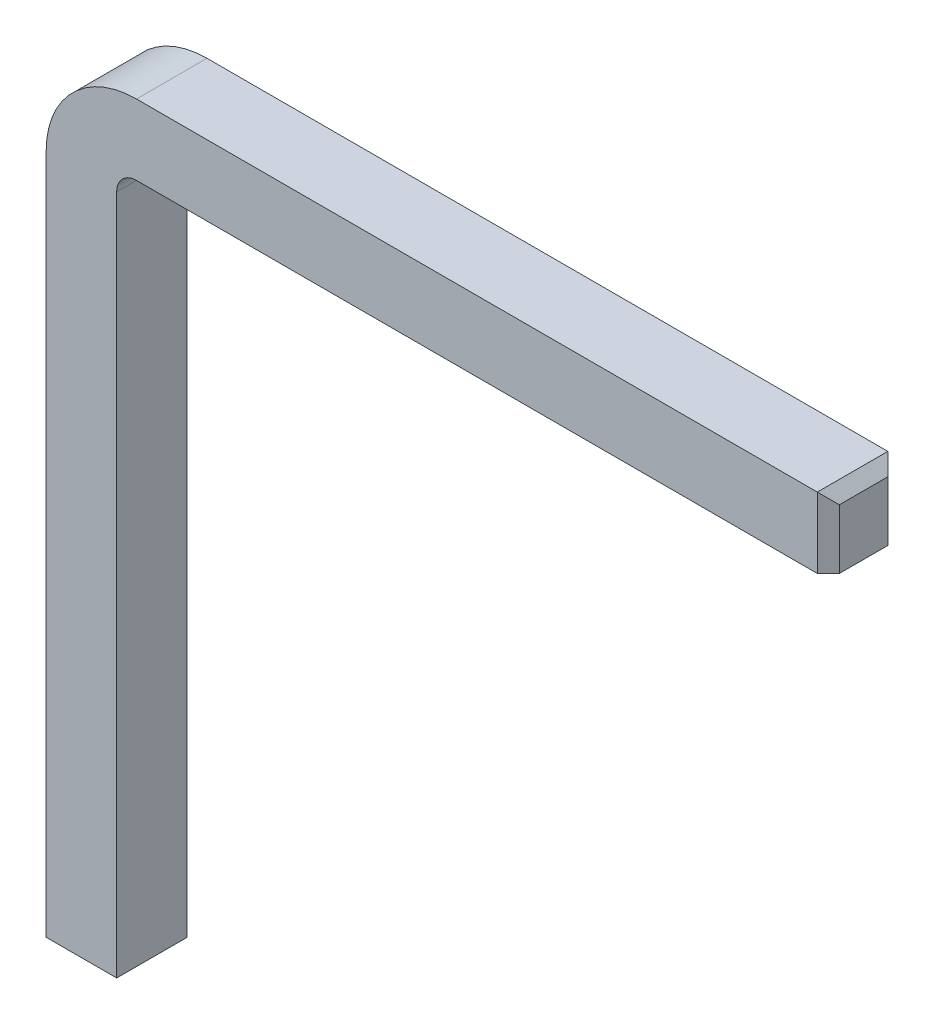
ISO-10303-21;
HEADER;
FILE_DESCRIPTION(('STEP AP214'),'2;1');
FILE_NAME('part.step','',(''),(''),'','','');
FILE_SCHEMA(('AUTOMOTIVE_DESIGN { 1 0 10303 214 1 1 1 1 }'));
ENDSEC;
DATA;
#1=APPLICATION_CONTEXT('core data for automotive mechanical design processes');
#2=APPLICATION_PROTOCOL_DEFINITION('international standard','automotive_design',2000,#1);
#3=PRODUCT_CONTEXT('',#1,'mechanical');
#4=PRODUCT('Part','Part','',(#3));
#5=PRODUCT_RELATED_PRODUCT_CATEGORY('part','',(#4));
#6=PRODUCT_DEFINITION_FORMATION('','',#4);
#7=PRODUCT_DEFINITION_CONTEXT('part definition',#1,'design');
#8=PRODUCT_DEFINITION('design','',#6,#7);
#9=PRODUCT_DEFINITION_SHAPE('','',#8);
#10=(LENGTH_UNIT() NAMED_UNIT(*) SI_UNIT(.MILLI.,.METRE.));
#11=(NAMED_UNIT(*) PLANE_ANGLE_UNIT() SI_UNIT($,.RADIAN.));
#12=(NAMED_UNIT(*) SI_UNIT($,.STERADIAN.) SOLID_ANGLE_UNIT());
#13=UNCERTAINTY_MEASURE_WITH_UNIT(LENGTH_MEASURE(1.E-05),#10,'distance_accuracy_value','');
#14=(GEOMETRIC_REPRESENTATION_CONTEXT(3) GLOBAL_UNCERTAINTY_ASSIGNED_CONTEXT((#13)) GLOBAL_UNIT_ASSIGNED_CONTEXT((#10,
#11,#12)) REPRESENTATION_CONTEXT('',''));
#15=CARTESIAN_POINT('',(0.,0.,0.));
#16=DIRECTION('',(0.,0.,1.));
#17=DIRECTION('',(1.,0.,0.));
#18=AXIS2_PLACEMENT_3D('',#15,#16,#17);
#19=CARTESIAN_POINT('',(0.5,7.1,-0.32));
#20=DIRECTION('',(0.,1.,0.));
#21=DIRECTION('',(-1.,0.,0.));
#22=AXIS2_PLACEMENT_3D('',#19,#20,#21);
#23=PLANE('',#22);
#24=DIRECTION('',(1.,0.,0.));
#25=VECTOR('',#24,1.);
#26=CARTESIAN_POINT('',(0.5,7.1,0.32));
#27=LINE('',#26,#25);
#28=CARTESIAN_POINT('',(0.5,7.1,0.32));
#29=VERTEX_POINT('',#28);
#30=CARTESIAN_POINT('',(6.68,7.1,0.32));
#31=VERTEX_POINT('',#30);
#32=EDGE_CURVE('E177',#29,#31,#27,.T.);
#33=ORIENTED_EDGE('',*,*,#32,.T.);
#34=DIRECTION('',(0.,0.,-1.));
#35=VECTOR('',#34,1.);
#36=CARTESIAN_POINT('',(6.68,7.1,-0.32));
#37=LINE('',#36,#35);
#38=CARTESIAN_POINT('',(6.68,7.1,-0.32));
#39=VERTEX_POINT('',#38);
#40=EDGE_CURVE('E11',#31,#39,#37,.T.);
#41=ORIENTED_EDGE('',*,*,#40,.T.);
#42=DIRECTION('',(1.,0.,0.));
#43=VECTOR('',#42,1.);
#44=CARTESIAN_POINT('',(0.5,7.1,-0.32));
#45=LINE('',#44,#43);
#46=CARTESIAN_POINT('',(0.5,7.1,-0.32));
#47=VERTEX_POINT('',#46);
#48=EDGE_CURVE('E180',#47,#39,#45,.T.);
#49=ORIENTED_EDGE('',*,*,#48,.F.);
#50=DIRECTION('',(0.,0.,1.));
#51=VECTOR('',#50,1.);
#52=CARTESIAN_POINT('',(0.5,7.1,-0.32));
#53=LINE('',#52,#51);
#54=EDGE_CURVE('E157',#47,#29,#53,.T.);
#55=ORIENTED_EDGE('',*,*,#54,.T.);
#56=EDGE_LOOP('',(#33,#41,#49,#55));
#57=FACE_BOUND('',#56,.T.);
#58=ADVANCED_FACE('F33',(#57),#23,.T.);
#59=CARTESIAN_POINT('',(0.5,6.46,-0.32));
#60=DIRECTION('',(0.,-1.,0.));
#61=DIRECTION('',(1.,0.,0.));
#62=AXIS2_PLACEMENT_3D('',#59,#60,#61);
#63=PLANE('',#62);
#64=DIRECTION('',(1.,0.,0.));
#65=VECTOR('',#64,1.);
#66=CARTESIAN_POINT('',(0.5,6.46,-0.32));
#67=LINE('',#66,#65);
#68=CARTESIAN_POINT('',(0.5,6.46,-0.32));
#69=VERTEX_POINT('',#68);
#70=CARTESIAN_POINT('',(6.68,6.46,-0.32));
#71=VERTEX_POINT('',#70);
#72=EDGE_CURVE('E133',#69,#71,#67,.T.);
#73=ORIENTED_EDGE('',*,*,#72,.T.);
#74=DIRECTION('',(0.707106781186548,0.,0.707106781186547));
#75=VECTOR('',#74,1.);
#76=CARTESIAN_POINT('',(3.59,6.46,-3.41));
#77=LINE('',#76,#75);
#78=CARTESIAN_POINT('',(6.78,6.46,-0.219999999999999));
#79=VERTEX_POINT('',#78);
#80=EDGE_CURVE('E42',#71,#79,#77,.T.);
#81=ORIENTED_EDGE('',*,*,#80,.T.);
#82=DIRECTION('',(0.,0.,-1.));
#83=VECTOR('',#82,1.);
#84=CARTESIAN_POINT('',(6.78,6.46,-0.32));
#85=LINE('',#84,#83);
#86=CARTESIAN_POINT('',(6.78,6.46,0.219999999999999));
#87=VERTEX_POINT('',#86);
#88=EDGE_CURVE('E137',#87,#79,#85,.T.);
#89=ORIENTED_EDGE('',*,*,#88,.F.);
#90=DIRECTION('',(-0.707106781186548,0.,0.707106781186547));
#91=VECTOR('',#90,1.);
#92=CARTESIAN_POINT('',(3.91,6.46,3.09));
#93=LINE('',#92,#91);
#94=CARTESIAN_POINT('',(6.68,6.46,0.32));
#95=VERTEX_POINT('',#94);
#96=EDGE_CURVE('E209',#87,#95,#93,.T.);
#97=ORIENTED_EDGE('',*,*,#96,.T.);
#98=DIRECTION('',(1.,0.,0.));
#99=VECTOR('',#98,1.);
#100=CARTESIAN_POINT('',(0.5,6.46,0.32));
#101=LINE('',#100,#99);
#102=CARTESIAN_POINT('',(0.5,6.46,0.32));
#103=VERTEX_POINT('',#102);
#104=EDGE_CURVE('E174',#103,#95,#101,.T.);
#105=ORIENTED_EDGE('',*,*,#104,.F.);
#106=DIRECTION('',(0.,0.,-1.));
#107=VECTOR('',#106,1.);
#108=CARTESIAN_POINT('',(0.5,6.46,-0.32));
#109=LINE('',#108,#107);
#110=EDGE_CURVE('E154',#103,#69,#109,.T.);
#111=ORIENTED_EDGE('',*,*,#110,.T.);
#112=EDGE_LOOP('',(#73,#81,#89,#97,#105,#111));
#113=FACE_BOUND('',#112,.T.);
#114=ADVANCED_FACE('F231',(#113),#63,.T.);
#115=CARTESIAN_POINT('',(0.5,6.28,0.));
#116=DIRECTION('',(0.,0.,-1.));
#117=DIRECTION('',(-1.,0.,0.));
#118=AXIS2_PLACEMENT_3D('',#115,#116,#117);
#119=CYLINDRICAL_SURFACE('',#118,0.819999999999999);
#120=DIRECTION('',(0.,0.,1.));
#121=VECTOR('',#120,1.);
#122=CARTESIAN_POINT('',(-0.319999999999999,6.28,-0.32));
#123=LINE('',#122,#121);
#124=CARTESIAN_POINT('',(-0.319999999999999,6.28,-0.32));
#125=VERTEX_POINT('',#124);
#126=CARTESIAN_POINT('',(-0.319999999999999,6.28,0.32));
#127=VERTEX_POINT('',#126);
#128=EDGE_CURVE('E148',#125,#127,#123,.T.);
#129=ORIENTED_EDGE('',*,*,#128,.T.);
#130=CARTESIAN_POINT('',(0.5,6.28,0.32));
#131=DIRECTION('',(0.,0.,-1.));
#132=DIRECTION('',(-1.,0.,0.));
#133=AXIS2_PLACEMENT_3D('',#130,#131,#132);
#134=CIRCLE('',#133,0.819999999999999);
#135=EDGE_CURVE('E167',#127,#29,#134,.T.);
#136=ORIENTED_EDGE('',*,*,#135,.T.);
#137=ORIENTED_EDGE('',*,*,#54,.F.);
#138=CARTESIAN_POINT('',(0.5,6.28,-0.32));
#139=DIRECTION('',(0.,0.,-1.));
#140=DIRECTION('',(-1.,0.,0.));
#141=AXIS2_PLACEMENT_3D('',#138,#139,#140);
#142=CIRCLE('',#141,0.819999999999999);
#143=EDGE_CURVE('E138',#125,#47,#142,.T.);
#144=ORIENTED_EDGE('',*,*,#143,.F.);
#145=EDGE_LOOP('',(#129,#136,#137,#144));
#146=FACE_BOUND('',#145,.T.);
#147=ADVANCED_FACE('F239',(#146),#119,.T.);
#148=CARTESIAN_POINT('',(0.5,6.28,0.));
#149=DIRECTION('',(0.,0.,-1.));
#150=DIRECTION('',(-1.,0.,0.));
#151=AXIS2_PLACEMENT_3D('',#148,#149,#150);
#152=CYLINDRICAL_SURFACE('',#151,0.179999999999999);
#153=DIRECTION('',(0.,0.,-1.));
#154=VECTOR('',#153,1.);
#155=CARTESIAN_POINT('',(0.320000000000001,6.28,-0.32));
#156=LINE('',#155,#154);
#157=CARTESIAN_POINT('',(0.320000000000001,6.28,0.32));
#158=VERTEX_POINT('',#157);
#159=CARTESIAN_POINT('',(0.320000000000001,6.28,-0.32));
#160=VERTEX_POINT('',#159);
#161=EDGE_CURVE('E141',#158,#160,#156,.T.);
#162=ORIENTED_EDGE('',*,*,#161,.T.);
#163=CARTESIAN_POINT('',(0.5,6.28,-0.32));
#164=DIRECTION('',(0.,0.,-1.));
#165=DIRECTION('',(-1.,0.,0.));
#166=AXIS2_PLACEMENT_3D('',#163,#164,#165);
#167=CIRCLE('',#166,0.179999999999999);
#168=EDGE_CURVE('E125',#160,#69,#167,.T.);
#169=ORIENTED_EDGE('',*,*,#168,.T.);
#170=ORIENTED_EDGE('',*,*,#110,.F.);
#171=CARTESIAN_POINT('',(0.5,6.28,0.32));
#172=DIRECTION('',(0.,0.,-1.));
#173=DIRECTION('',(-1.,0.,0.));
#174=AXIS2_PLACEMENT_3D('',#171,#172,#173);
#175=CIRCLE('',#174,0.179999999999999);
#176=EDGE_CURVE('E144',#158,#103,#175,.T.);
#177=ORIENTED_EDGE('',*,*,#176,.F.);
#178=EDGE_LOOP('',(#162,#169,#170,#177));
#179=FACE_BOUND('',#178,.T.);
#180=ADVANCED_FACE('F142',(#179),#152,.F.);
#181=CARTESIAN_POINT('',(0.320000000000001,6.28,-0.32));
#182=DIRECTION('',(-1.,0.,0.));
#183=DIRECTION('',(0.,0.,1.));
#184=AXIS2_PLACEMENT_3D('',#181,#182,#183);
#185=PLANE('',#184);
#186=DIRECTION('',(0.,-1.,0.));
#187=VECTOR('',#186,1.);
#188=CARTESIAN_POINT('',(0.320000000000001,6.28,0.32));
#189=LINE('',#188,#187);
#190=CARTESIAN_POINT('',(0.320000000000001,0.1,0.32));
#191=VERTEX_POINT('',#190);
#192=EDGE_CURVE('E246',#158,#191,#189,.T.);
#193=ORIENTED_EDGE('',*,*,#192,.T.);
#194=DIRECTION('',(0.,0.,-1.));
#195=VECTOR('',#194,1.);
#196=CARTESIAN_POINT('',(0.320000000000001,0.1,-0.32));
#197=LINE('',#196,#195);
#198=CARTESIAN_POINT('',(0.320000000000001,0.1,-0.32));
#199=VERTEX_POINT('',#198);
#200=EDGE_CURVE('E153',#191,#199,#197,.T.);
#201=ORIENTED_EDGE('',*,*,#200,.T.);
#202=DIRECTION('',(0.,-1.,0.));
#203=VECTOR('',#202,1.);
#204=CARTESIAN_POINT('',(0.320000000000001,6.28,-0.32));
#205=LINE('',#204,#203);
#206=EDGE_CURVE('E130',#160,#199,#205,.T.);
#207=ORIENTED_EDGE('',*,*,#206,.F.);
#208=ORIENTED_EDGE('',*,*,#161,.F.);
#209=EDGE_LOOP('',(#193,#201,#207,#208));
#210=FACE_BOUND('',#209,.T.);
#211=ADVANCED_FACE('F151',(#210),#185,.F.);
#212=CARTESIAN_POINT('',(-0.319999999999999,6.28,-0.32));
#213=DIRECTION('',(0.,0.,1.));
#214=DIRECTION('',(1.,0.,0.));
#215=AXIS2_PLACEMENT_3D('',#212,#213,#214);
#216=PLANE('',#215);
#217=ORIENTED_EDGE('',*,*,#206,.T.);
#218=DIRECTION('',(-1.,0.,0.));
#219=VECTOR('',#218,1.);
#220=CARTESIAN_POINT('',(-0.319999999999999,0.1,-0.32));
#221=LINE('',#220,#219);
#222=CARTESIAN_POINT('',(-0.319999999999999,0.1,-0.32));
#223=VERTEX_POINT('',#222);
#224=EDGE_CURVE('E186',#199,#223,#221,.T.);
#225=ORIENTED_EDGE('',*,*,#224,.T.);
#226=DIRECTION('',(0.,-1.,0.));
#227=VECTOR('',#226,1.);
#228=CARTESIAN_POINT('',(-0.319999999999999,6.28,-0.32));
#229=LINE('',#228,#227);
#230=EDGE_CURVE('E155',#125,#223,#229,.T.);
#231=ORIENTED_EDGE('',*,*,#230,.F.);
#232=ORIENTED_EDGE('',*,*,#143,.T.);
#233=ORIENTED_EDGE('',*,*,#48,.T.);
#234=DIRECTION('',(0.,-1.,0.));
#235=VECTOR('',#234,1.);
#236=CARTESIAN_POINT('',(6.68,6.46,-0.32));
#237=LINE('',#236,#235);
#238=EDGE_CURVE('E184',#39,#71,#237,.T.);
#239=ORIENTED_EDGE('',*,*,#238,.T.);
#240=ORIENTED_EDGE('',*,*,#72,.F.);
#241=ORIENTED_EDGE('',*,*,#168,.F.);
#242=EDGE_LOOP('',(#217,#225,#231,#232,#233,#239,#240,#241));
#243=FACE_BOUND('',#242,.T.);
#244=ADVANCED_FACE('F127',(#243),#216,.F.);
#245=CARTESIAN_POINT('',(-0.319999999999999,6.28,-0.32));
#246=DIRECTION('',(1.,0.,0.));
#247=DIRECTION('',(0.,0.,-1.));
#248=AXIS2_PLACEMENT_3D('',#245,#246,#247);
#249=PLANE('',#248);
#250=ORIENTED_EDGE('',*,*,#230,.T.);
#251=DIRECTION('',(0.,0.,1.));
#252=VECTOR('',#251,1.);
#253=CARTESIAN_POINT('',(-0.319999999999999,0.1,-0.32));
#254=LINE('',#253,#252);
#255=CARTESIAN_POINT('',(-0.319999999999999,0.1,0.32));
#256=VERTEX_POINT('',#255);
#257=EDGE_CURVE('E197',#223,#256,#254,.T.);
#258=ORIENTED_EDGE('',*,*,#257,.T.);
#259=DIRECTION('',(0.,-1.,0.));
#260=VECTOR('',#259,1.);
#261=CARTESIAN_POINT('',(-0.319999999999999,6.28,0.32));
#262=LINE('',#261,#260);
#263=EDGE_CURVE('E160',#127,#256,#262,.T.);
#264=ORIENTED_EDGE('',*,*,#263,.F.);
#265=ORIENTED_EDGE('',*,*,#128,.F.);
#266=EDGE_LOOP('',(#250,#258,#264,#265));
#267=FACE_BOUND('',#266,.T.);
#268=ADVANCED_FACE('F264',(#267),#249,.F.);
#269=CARTESIAN_POINT('',(-0.319999999999999,6.28,0.32));
#270=DIRECTION('',(0.,0.,-1.));
#271=DIRECTION('',(-1.,0.,0.));
#272=AXIS2_PLACEMENT_3D('',#269,#270,#271);
#273=PLANE('',#272);
#274=ORIENTED_EDGE('',*,*,#263,.T.);
#275=DIRECTION('',(1.,0.,0.));
#276=VECTOR('',#275,1.);
#277=CARTESIAN_POINT('',(-0.319999999999999,0.1,0.32));
#278=LINE('',#277,#276);
#279=EDGE_CURVE('E201',#256,#191,#278,.T.);
#280=ORIENTED_EDGE('',*,*,#279,.T.);
#281=ORIENTED_EDGE('',*,*,#192,.F.);
#282=ORIENTED_EDGE('',*,*,#176,.T.);
#283=ORIENTED_EDGE('',*,*,#104,.T.);
#284=DIRECTION('',(0.,1.,0.));
#285=VECTOR('',#284,1.);
#286=CARTESIAN_POINT('',(6.68,7.1,0.32));
#287=LINE('',#286,#285);
#288=EDGE_CURVE('E199',#95,#31,#287,.T.);
#289=ORIENTED_EDGE('',*,*,#288,.T.);
#290=ORIENTED_EDGE('',*,*,#32,.F.);
#291=ORIENTED_EDGE('',*,*,#135,.F.);
#292=EDGE_LOOP('',(#274,#280,#281,#282,#283,#289,#290,#291));
#293=FACE_BOUND('',#292,.T.);
#294=ADVANCED_FACE('F244',(#293),#273,.F.);
#295=CARTESIAN_POINT('',(6.78,6.78,0.));
#296=DIRECTION('',(1.,0.,0.));
#297=DIRECTION('',(0.,0.,1.));
#298=AXIS2_PLACEMENT_3D('',#295,#296,#297);
#299=PLANE('',#298);
#300=ORIENTED_EDGE('',*,*,#88,.T.);
#301=DIRECTION('',(0.,1.,0.));
#302=VECTOR('',#301,1.);
#303=CARTESIAN_POINT('',(6.78,7.1,-0.219999999999999));
#304=LINE('',#303,#302);
#305=CARTESIAN_POINT('',(6.78,7.,-0.219999999999999));
#306=VERTEX_POINT('',#305);
#307=EDGE_CURVE('E207',#79,#306,#304,.T.);
#308=ORIENTED_EDGE('',*,*,#307,.T.);
#309=DIRECTION('',(0.,0.,1.));
#310=VECTOR('',#309,1.);
#311=CARTESIAN_POINT('',(6.78,7.,0.));
#312=LINE('',#311,#310);
#313=CARTESIAN_POINT('',(6.78,7.,0.219999999999999));
#314=VERTEX_POINT('',#313);
#315=EDGE_CURVE('E57',#306,#314,#312,.T.);
#316=ORIENTED_EDGE('',*,*,#315,.T.);
#317=DIRECTION('',(0.,-1.,0.));
#318=VECTOR('',#317,1.);
#319=CARTESIAN_POINT('',(6.78,6.46,0.219999999999999));
#320=LINE('',#319,#318);
#321=EDGE_CURVE('E204',#314,#87,#320,.T.);
#322=ORIENTED_EDGE('',*,*,#321,.T.);
#323=EDGE_LOOP('',(#300,#308,#316,#322));
#324=FACE_BOUND('',#323,.T.);
#325=ADVANCED_FACE('F229',(#324),#299,.T.);
#326=CARTESIAN_POINT('',(0.,0.,0.));
#327=DIRECTION('',(0.,1.,0.));
#328=DIRECTION('',(0.,0.,1.));
#329=AXIS2_PLACEMENT_3D('',#326,#327,#328);
#330=PLANE('',#329);
#331=DIRECTION('',(0.,0.,-1.));
#332=VECTOR('',#331,1.);
#333=CARTESIAN_POINT('',(-0.219999999999999,0.,0.));
#334=LINE('',#333,#332);
#335=CARTESIAN_POINT('',(-0.219999999999999,0.,0.22));
#336=VERTEX_POINT('',#335);
#337=CARTESIAN_POINT('',(-0.219999999999999,0.,-0.22));
#338=VERTEX_POINT('',#337);
#339=EDGE_CURVE('E192',#336,#338,#334,.T.);
#340=ORIENTED_EDGE('',*,*,#339,.T.);
#341=DIRECTION('',(1.,0.,0.));
#342=VECTOR('',#341,1.);
#343=CARTESIAN_POINT('',(0.,0.,-0.22));
#344=LINE('',#343,#342);
#345=CARTESIAN_POINT('',(0.220000000000001,0.,-0.22));
#346=VERTEX_POINT('',#345);
#347=EDGE_CURVE('E194',#338,#346,#344,.T.);
#348=ORIENTED_EDGE('',*,*,#347,.T.);
#349=DIRECTION('',(0.,0.,1.));
#350=VECTOR('',#349,1.);
#351=CARTESIAN_POINT('',(0.220000000000001,0.,0.));
#352=LINE('',#351,#350);
#353=CARTESIAN_POINT('',(0.220000000000001,0.,0.22));
#354=VERTEX_POINT('',#353);
#355=EDGE_CURVE('E188',#346,#354,#352,.T.);
#356=ORIENTED_EDGE('',*,*,#355,.T.);
#357=DIRECTION('',(-1.,0.,0.));
#358=VECTOR('',#357,1.);
#359=CARTESIAN_POINT('',(0.,0.,0.22));
#360=LINE('',#359,#358);
#361=EDGE_CURVE('E190',#354,#336,#360,.T.);
#362=ORIENTED_EDGE('',*,*,#361,.T.);
#363=EDGE_LOOP('',(#340,#348,#356,#362));
#364=FACE_BOUND('',#363,.T.);
#365=ADVANCED_FACE('F269',(#364),#330,.F.);
#366=CARTESIAN_POINT('',(-0.319999999999999,0.1,0.32));
#367=DIRECTION('',(0.,0.707106781186547,-0.707106781186547));
#368=DIRECTION('',(1.,0.,0.));
#369=AXIS2_PLACEMENT_3D('',#366,#367,#368);
#370=PLANE('',#369);
#371=DIRECTION('',(0.577350269189626,-0.577350269189626,-0.577350269189626));
#372=VECTOR('',#371,1.);
#373=CARTESIAN_POINT('',(-0.319999999999999,0.1,0.32));
#374=LINE('',#373,#372);
#375=EDGE_CURVE('E216',#336,#256,#374,.F.);
#376=ORIENTED_EDGE('',*,*,#375,.F.);
#377=ORIENTED_EDGE('',*,*,#361,.F.);
#378=DIRECTION('',(-0.577350269189626,-0.577350269189626,-0.577350269189626));
#379=VECTOR('',#378,1.);
#380=CARTESIAN_POINT('',(0.106666666666667,-0.113333333333333,0.106666666666667));
#381=LINE('',#380,#379);
#382=EDGE_CURVE('E149',#191,#354,#381,.T.);
#383=ORIENTED_EDGE('',*,*,#382,.F.);
#384=ORIENTED_EDGE('',*,*,#279,.F.);
#385=EDGE_LOOP('',(#376,#377,#383,#384));
#386=FACE_BOUND('',#385,.T.);
#387=ADVANCED_FACE('F253',(#386),#370,.F.);
#388=CARTESIAN_POINT('',(0.320000000000001,0.1,-0.32));
#389=DIRECTION('',(-0.707106781186547,0.707106781186547,0.));
#390=DIRECTION('',(0.,0.,-1.));
#391=AXIS2_PLACEMENT_3D('',#388,#389,#390);
#392=PLANE('',#391);
#393=ORIENTED_EDGE('',*,*,#382,.T.);
#394=ORIENTED_EDGE('',*,*,#355,.F.);
#395=DIRECTION('',(0.577350269189626,0.577350269189626,-0.577350269189626));
#396=VECTOR('',#395,1.);
#397=CARTESIAN_POINT('',(0.320000000000001,0.1,-0.32));
#398=LINE('',#397,#396);
#399=EDGE_CURVE('E214',#199,#346,#398,.F.);
#400=ORIENTED_EDGE('',*,*,#399,.F.);
#401=ORIENTED_EDGE('',*,*,#200,.F.);
#402=EDGE_LOOP('',(#393,#394,#400,#401));
#403=FACE_BOUND('',#402,.T.);
#404=ADVANCED_FACE('F256',(#403),#392,.F.);
#405=CARTESIAN_POINT('',(-0.319999999999999,0.1,-0.32));
#406=DIRECTION('',(0.707106781186547,0.707106781186547,0.));
#407=DIRECTION('',(0.,0.,1.));
#408=AXIS2_PLACEMENT_3D('',#405,#406,#407);
#409=PLANE('',#408);
#410=ORIENTED_EDGE('',*,*,#375,.T.);
#411=ORIENTED_EDGE('',*,*,#257,.F.);
#412=DIRECTION('',(0.577350269189626,-0.577350269189626,0.577350269189626));
#413=VECTOR('',#412,1.);
#414=CARTESIAN_POINT('',(-0.319999999999999,0.1,-0.32));
#415=LINE('',#414,#413);
#416=EDGE_CURVE('E212',#338,#223,#415,.F.);
#417=ORIENTED_EDGE('',*,*,#416,.F.);
#418=ORIENTED_EDGE('',*,*,#339,.F.);
#419=EDGE_LOOP('',(#410,#411,#417,#418));
#420=FACE_BOUND('',#419,.T.);
#421=ADVANCED_FACE('F266',(#420),#409,.F.);
#422=CARTESIAN_POINT('',(-0.319999999999999,0.1,-0.32));
#423=DIRECTION('',(0.,0.707106781186547,0.707106781186547));
#424=DIRECTION('',(-1.,0.,0.));
#425=AXIS2_PLACEMENT_3D('',#422,#423,#424);
#426=PLANE('',#425);
#427=ORIENTED_EDGE('',*,*,#399,.T.);
#428=ORIENTED_EDGE('',*,*,#347,.F.);
#429=ORIENTED_EDGE('',*,*,#416,.T.);
#430=ORIENTED_EDGE('',*,*,#224,.F.);
#431=EDGE_LOOP('',(#427,#428,#429,#430));
#432=FACE_BOUND('',#431,.T.);
#433=ADVANCED_FACE('F260',(#432),#426,.F.);
#434=CARTESIAN_POINT('',(6.78,6.78,0.219999999999999));
#435=DIRECTION('',(0.707106781186547,0.,0.707106781186548));
#436=DIRECTION('',(0.,1.,0.));
#437=AXIS2_PLACEMENT_3D('',#434,#435,#436);
#438=PLANE('',#437);
#439=ORIENTED_EDGE('',*,*,#96,.F.);
#440=ORIENTED_EDGE('',*,*,#321,.F.);
#441=DIRECTION('',(0.577350269189626,-0.577350269189626,-0.577350269189626));
#442=VECTOR('',#441,1.);
#443=CARTESIAN_POINT('',(6.85333333333333,6.92666666666666,0.146666666666666));
#444=LINE('',#443,#442);
#445=EDGE_CURVE('E37',#31,#314,#444,.T.);
#446=ORIENTED_EDGE('',*,*,#445,.F.);
#447=ORIENTED_EDGE('',*,*,#288,.F.);
#448=EDGE_LOOP('',(#439,#440,#446,#447));
#449=FACE_BOUND('',#448,.T.);
#450=ADVANCED_FACE('F35',(#449),#438,.T.);
#451=CARTESIAN_POINT('',(6.78,7.,0.));
#452=DIRECTION('',(-0.707106781186547,-0.707106781186547,0.));
#453=DIRECTION('',(0.,0.,1.));
#454=AXIS2_PLACEMENT_3D('',#451,#452,#453);
#455=PLANE('',#454);
#456=ORIENTED_EDGE('',*,*,#445,.T.);
#457=ORIENTED_EDGE('',*,*,#315,.F.);
#458=DIRECTION('',(0.577350269189626,-0.577350269189626,0.577350269189626));
#459=VECTOR('',#458,1.);
#460=CARTESIAN_POINT('',(6.85333333333333,6.92666666666666,-0.146666666666666));
#461=LINE('',#460,#459);
#462=EDGE_CURVE('E50',#39,#306,#461,.T.);
#463=ORIENTED_EDGE('',*,*,#462,.F.);
#464=ORIENTED_EDGE('',*,*,#40,.F.);
#465=EDGE_LOOP('',(#456,#457,#463,#464));
#466=FACE_BOUND('',#465,.T.);
#467=ADVANCED_FACE('F224',(#466),#455,.F.);
#468=CARTESIAN_POINT('',(6.78,6.78,-0.219999999999999));
#469=DIRECTION('',(0.707106781186547,0.,-0.707106781186548));
#470=DIRECTION('',(0.,-1.,0.));
#471=AXIS2_PLACEMENT_3D('',#468,#469,#470);
#472=PLANE('',#471);
#473=ORIENTED_EDGE('',*,*,#80,.F.);
#474=ORIENTED_EDGE('',*,*,#238,.F.);
#475=ORIENTED_EDGE('',*,*,#462,.T.);
#476=ORIENTED_EDGE('',*,*,#307,.F.);
#477=EDGE_LOOP('',(#473,#474,#475,#476));
#478=FACE_BOUND('',#477,.T.);
#479=ADVANCED_FACE('F233',(#478),#472,.T.);
#480=CLOSED_SHELL('',(#58,#114,#147,#180,#211,#244,#268,#294,#325,#365,#387,#404,#421,#433,#450,
#467,#479));
#481=MANIFOLD_SOLID_BREP('B2',#480);
#482=ADVANCED_BREP_SHAPE_REPRESENTATION('',(#18,#481),#14);
#483=SHAPE_DEFINITION_REPRESENTATION(#9,#482);
ENDSEC;
END-ISO-10303-21;
